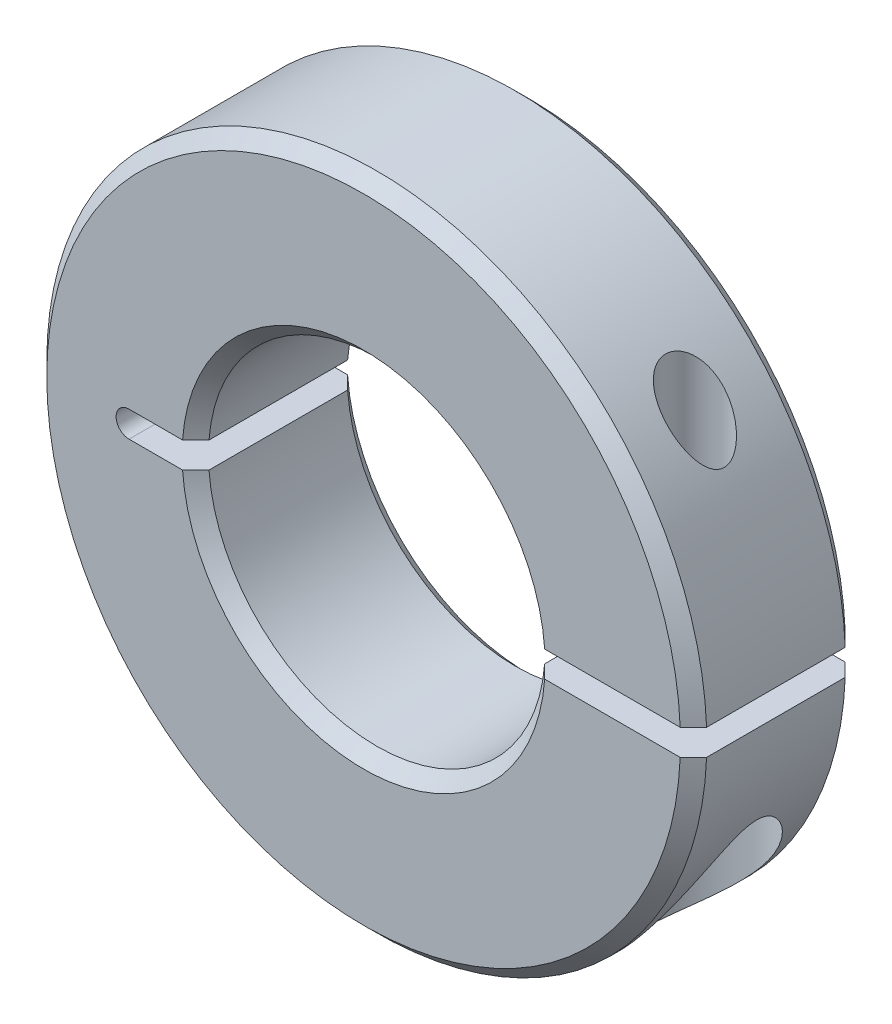
ISO-10303-21;
HEADER;
FILE_DESCRIPTION(('STEP AP214'),'2;1');
FILE_NAME('part.step','',(''),(''),'','','');
FILE_SCHEMA(('AUTOMOTIVE_DESIGN { 1 0 10303 214 1 1 1 1 }'));
ENDSEC;
DATA;
#1=APPLICATION_CONTEXT('core data for automotive mechanical design processes');
#2=APPLICATION_PROTOCOL_DEFINITION('international standard','automotive_design',2000,#1);
#3=PRODUCT_CONTEXT('',#1,'mechanical');
#4=PRODUCT('Part','Part','',(#3));
#5=PRODUCT_RELATED_PRODUCT_CATEGORY('part','',(#4));
#6=PRODUCT_DEFINITION_FORMATION('','',#4);
#7=PRODUCT_DEFINITION_CONTEXT('part definition',#1,'design');
#8=PRODUCT_DEFINITION('design','',#6,#7);
#9=PRODUCT_DEFINITION_SHAPE('','',#8);
#10=(LENGTH_UNIT() NAMED_UNIT(*) SI_UNIT(.MILLI.,.METRE.));
#11=(NAMED_UNIT(*) PLANE_ANGLE_UNIT() SI_UNIT($,.RADIAN.));
#12=(NAMED_UNIT(*) SI_UNIT($,.STERADIAN.) SOLID_ANGLE_UNIT());
#13=UNCERTAINTY_MEASURE_WITH_UNIT(LENGTH_MEASURE(1.E-05),#10,'distance_accuracy_value','');
#14=(GEOMETRIC_REPRESENTATION_CONTEXT(3) GLOBAL_UNCERTAINTY_ASSIGNED_CONTEXT((#13)) GLOBAL_UNIT_ASSIGNED_CONTEXT((#10,
#11,#12)) REPRESENTATION_CONTEXT('',''));
#15=CARTESIAN_POINT('',(0.,0.,0.));
#16=DIRECTION('',(0.,0.,1.));
#17=DIRECTION('',(1.,0.,0.));
#18=AXIS2_PLACEMENT_3D('',#15,#16,#17);
#19=CARTESIAN_POINT('',(5.0585421498754,0.0836122983138548,0.602080490523428));
#20=DIRECTION('',(0.,1.,0.));
#21=DIRECTION('',(0.,0.,1.));
#22=AXIS2_PLACEMENT_3D('',#19,#20,#21);
#23=PLANE('',#22);
#24=CARTESIAN_POINT('',(5.0585421498754,0.0836122983138548,0.602080490523428));
#25=DIRECTION('',(0.,1.,0.));
#26=DIRECTION('',(0.,0.,1.));
#27=AXIS2_PLACEMENT_3D('',#24,#25,#26);
#28=CIRCLE('',#27,1.63195);
#29=CARTESIAN_POINT('',(5.0585421498754,0.0836122983138548,2.23403049052343));
#30=VERTEX_POINT('',#29);
#31=EDGE_CURVE('E158',#30,#30,#28,.T.);
#32=ORIENTED_EDGE('',*,*,#31,.T.);
#33=EDGE_LOOP('',(#32));
#34=FACE_BOUND('',#33,.T.);
#35=CARTESIAN_POINT('',(5.0585421498754,0.0836122983138808,0.602080490523428));
#36=DIRECTION('',(0.,1.,0.));
#37=DIRECTION('',(0.,0.,1.));
#38=AXIS2_PLACEMENT_3D('',#35,#36,#37);
#39=CIRCLE('',#38,2.38125);
#40=CARTESIAN_POINT('',(5.0585421498754,0.0836122983138808,2.98333049052343));
#41=VERTEX_POINT('',#40);
#42=EDGE_CURVE('E212',#41,#41,#39,.F.);
#43=ORIENTED_EDGE('',*,*,#42,.T.);
#44=EDGE_LOOP('',(#43));
#45=FACE_BOUND('',#44,.T.);
#46=ADVANCED_FACE('F16',(#34,#45),#23,.F.);
#47=CARTESIAN_POINT('',(-4.51537073370326,2.61561229831282,3.77708049046532));
#48=DIRECTION('',(0.,0.,1.));
#49=DIRECTION('',(1.,0.,0.));
#50=AXIS2_PLACEMENT_3D('',#47,#48,#49);
#51=CONICAL_SURFACE('',#50,6.98499999991889,0.785398163397448);
#52=CARTESIAN_POINT('',(1.94230137007956,2.1156122983138,3.26908049054441));
#53=CARTESIAN_POINT('',(2.02721181713312,2.1156122983138,3.35373825603141));
#54=CARTESIAN_POINT('',(2.11211782590768,2.1156122983138,3.4384004721112));
#55=CARTESIAN_POINT('',(2.28192096688123,2.1156122983138,3.6077338054388));
#56=CARTESIAN_POINT('',(2.36681809908021,2.1156122983138,3.69240492268661));
#57=CARTESIAN_POINT('',(2.4517107930002,2.1156122983138,3.77708049052722));
#58=B_SPLINE_CURVE_WITH_KNOTS('',3,(#52,#53,#54,#55,#56,#57),.UNSPECIFIED.,.F.,.F.,(4,2,4),(0.,
0.359708896773636,0.719417793472673),.UNSPECIFIED.);
#59=CARTESIAN_POINT('',(1.94230137008047,2.1156122983138,3.26908049053367));
#60=VERTEX_POINT('',#59);
#61=CARTESIAN_POINT('',(2.45171079299767,2.1156122983138,3.77708049052469));
#62=VERTEX_POINT('',#61);
#63=EDGE_CURVE('E127',#60,#62,#58,.T.);
#64=ORIENTED_EDGE('',*,*,#63,.F.);
#65=CARTESIAN_POINT('',(-4.51537073370326,2.61561229831282,3.26908049052292));
#66=DIRECTION('',(0.,0.,-1.));
#67=DIRECTION('',(-1.,0.,0.));
#68=AXIS2_PLACEMENT_3D('',#65,#66,#67);
#69=CIRCLE('',#68,6.477);
#70=CARTESIAN_POINT('',(-10.9730428374867,2.1156122983138,3.26908049053363));
#71=VERTEX_POINT('',#70);
#72=EDGE_CURVE('E122',#60,#71,#69,.T.);
#73=ORIENTED_EDGE('',*,*,#72,.T.);
#74=CARTESIAN_POINT('',(-11.4824522604069,2.1156122983138,3.77708049052737));
#75=CARTESIAN_POINT('',(-11.3975595664868,2.1156122983138,3.69240492268673));
#76=CARTESIAN_POINT('',(-11.3126624342878,2.1156122983138,3.60773380543888));
#77=CARTESIAN_POINT('',(-11.1428592933142,2.1156122983138,3.4384004721112));
#78=CARTESIAN_POINT('',(-11.0579532845396,2.1156122983138,3.35373825603138));
#79=CARTESIAN_POINT('',(-10.973042837486,2.1156122983138,3.26908049054435));
#80=B_SPLINE_CURVE_WITH_KNOTS('',3,(#74,#75,#76,#77,#78,#79),.UNSPECIFIED.,.F.,.F.,(4,2,4),(0.,
0.35970889669919,0.71941779347298),.UNSPECIFIED.);
#81=CARTESIAN_POINT('',(-11.4824522604043,2.1156122983138,3.77708049052477));
#82=VERTEX_POINT('',#81);
#83=EDGE_CURVE('E19',#82,#71,#80,.T.);
#84=ORIENTED_EDGE('',*,*,#83,.F.);
#85=CARTESIAN_POINT('',(-4.51537073370326,2.61561229831282,3.77708049052217));
#86=DIRECTION('',(0.,0.,1.));
#87=DIRECTION('',(1.,0.,0.));
#88=AXIS2_PLACEMENT_3D('',#85,#86,#87);
#89=CIRCLE('',#88,6.98499999997574);
#90=EDGE_CURVE('E119',#62,#82,#89,.F.);
#91=ORIENTED_EDGE('',*,*,#90,.F.);
#92=EDGE_LOOP('',(#64,#73,#84,#91));
#93=FACE_BOUND('',#92,.T.);
#94=ADVANCED_FACE('F118',(#93),#51,.F.);
#95=CARTESIAN_POINT('',(-4.51537073370326,2.61561229831282,3.77708049046532));
#96=DIRECTION('',(0.,0.,1.));
#97=DIRECTION('',(1.,0.,0.));
#98=AXIS2_PLACEMENT_3D('',#95,#96,#97);
#99=CONICAL_SURFACE('',#98,6.98499999991889,0.785398163397448);
#100=CARTESIAN_POINT('',(-10.9730428374859,3.11561229831336,3.26908049054436));
#101=CARTESIAN_POINT('',(-11.0579532845395,3.11561229831336,3.35373825603139));
#102=CARTESIAN_POINT('',(-11.1428592933141,3.11561229831336,3.43840047211122));
#103=CARTESIAN_POINT('',(-11.3126624342877,3.11561229831336,3.6077338054389));
#104=CARTESIAN_POINT('',(-11.3975595664868,3.11561229831336,3.69240492268675));
#105=CARTESIAN_POINT('',(-11.4824522604068,3.11561229831336,3.77708049052739));
#106=B_SPLINE_CURVE_WITH_KNOTS('',3,(#100,#101,#102,#103,#104,#105),.UNSPECIFIED.,.F.,.F.,(4,2,
4),(0.,0.359708896773799,0.719417793472996),.UNSPECIFIED.);
#107=CARTESIAN_POINT('',(-10.9730428374867,3.11561229831336,3.26908049053364));
#108=VERTEX_POINT('',#107);
#109=CARTESIAN_POINT('',(-11.4824522604042,3.11561229831336,3.77708049052478));
#110=VERTEX_POINT('',#109);
#111=EDGE_CURVE('E232',#108,#110,#106,.T.);
#112=ORIENTED_EDGE('',*,*,#111,.F.);
#113=CARTESIAN_POINT('',(-4.51537073370326,2.61561229831282,3.26908049052292));
#114=DIRECTION('',(0.,0.,-1.));
#115=DIRECTION('',(-1.,0.,0.));
#116=AXIS2_PLACEMENT_3D('',#113,#114,#115);
#117=CIRCLE('',#116,6.477);
#118=CARTESIAN_POINT('',(1.94230137008042,3.11561229831336,3.26908049053367));
#119=VERTEX_POINT('',#118);
#120=EDGE_CURVE('E325',#108,#119,#117,.T.);
#121=ORIENTED_EDGE('',*,*,#120,.T.);
#122=CARTESIAN_POINT('',(2.45171079300011,3.11561229831336,3.77708049052724));
#123=CARTESIAN_POINT('',(2.36681809908012,3.11561229831336,3.69240492268663));
#124=CARTESIAN_POINT('',(2.28192096688113,3.11561229831336,3.60773380543882));
#125=CARTESIAN_POINT('',(2.11211782590758,3.11561229831336,3.43840047211121));
#126=CARTESIAN_POINT('',(2.02721181713302,3.11561229831336,3.35373825603142));
#127=CARTESIAN_POINT('',(1.94230137007946,3.11561229831336,3.26908049054443));
#128=B_SPLINE_CURVE_WITH_KNOTS('',3,(#122,#123,#124,#125,#126,#127),.UNSPECIFIED.,.F.,.F.,(4,2,
4),(0.,0.359708896699044,0.719417793472688),.UNSPECIFIED.);
#129=CARTESIAN_POINT('',(2.45171079299757,3.11561229831336,3.7770804905247));
#130=VERTEX_POINT('',#129);
#131=EDGE_CURVE('E259',#130,#119,#128,.T.);
#132=ORIENTED_EDGE('',*,*,#131,.F.);
#133=CARTESIAN_POINT('',(-4.51537073370326,2.61561229831282,3.77708049052217));
#134=DIRECTION('',(0.,0.,1.));
#135=DIRECTION('',(1.,0.,0.));
#136=AXIS2_PLACEMENT_3D('',#133,#134,#135);
#137=CIRCLE('',#136,6.98499999997574);
#138=EDGE_CURVE('E404',#110,#130,#137,.F.);
#139=ORIENTED_EDGE('',*,*,#138,.F.);
#140=EDGE_LOOP('',(#112,#121,#132,#139));
#141=FACE_BOUND('',#140,.T.);
#142=ADVANCED_FACE('F265',(#141),#99,.F.);
#143=CARTESIAN_POINT('',(5.0585421498754,-10.0843877016872,0.602080490523428));
#144=DIRECTION('',(0.,1.,0.));
#145=DIRECTION('',(0.,0.,1.));
#146=AXIS2_PLACEMENT_3D('',#143,#144,#145);
#147=CYLINDRICAL_SURFACE('',#146,2.38125);
#148=ORIENTED_EDGE('',*,*,#42,.F.);
#149=EDGE_LOOP('',(#148));
#150=FACE_BOUND('',#149,.T.);
#151=CARTESIAN_POINT('',(5.05854214987587,-5.72885845168909,2.98333049052343));
#152=CARTESIAN_POINT('',(5.1636729661427,-5.60824059387987,2.98332926045928));
#153=CARTESIAN_POINT('',(5.26648529143292,-5.48566643382376,2.97638273128389));
#154=CARTESIAN_POINT('',(5.46683857369114,-5.23747268409364,2.95024106640301));
#155=CARTESIAN_POINT('',(5.56437661840899,-5.11185146629979,2.93103923722344));
#156=CARTESIAN_POINT('',(5.75384258269392,-4.85823308520226,2.88166611622152));
#157=CARTESIAN_POINT('',(5.84576031840472,-4.73023212679233,2.85147556315454));
#158=CARTESIAN_POINT('',(6.02352997933439,-4.47283135103545,2.78113665868113));
#159=CARTESIAN_POINT('',(6.1093833167514,-4.34343186750511,2.74099063546233));
#160=CARTESIAN_POINT('',(6.278933009773,-4.07759677896215,2.64921056468325));
#161=CARTESIAN_POINT('',(6.36232148811594,-3.94112499515531,2.59711283051411));
#162=CARTESIAN_POINT('',(6.52218077902737,-3.66829260641997,2.48297437047656));
#163=CARTESIAN_POINT('',(6.598651389301,-3.53193200485817,2.42093335398994));
#164=CARTESIAN_POINT('',(6.74485836653093,-3.2598580908083,2.28630989782759));
#165=CARTESIAN_POINT('',(6.81456464788705,-3.12415001283055,2.21368366407462));
#166=CARTESIAN_POINT('',(6.91350540932779,-2.92301431895487,2.09609223743806));
#167=CARTESIAN_POINT('',(6.94553700223406,-2.85640083103791,2.05547186807675));
#168=CARTESIAN_POINT('',(7.00766808685965,-2.7243217000318,1.97102565217308));
#169=CARTESIAN_POINT('',(7.03776795435329,-2.65885583550995,1.92720043263368));
#170=CARTESIAN_POINT('',(7.09790374711412,-2.52516434442873,1.8328117690146));
#171=CARTESIAN_POINT('',(7.12779637468702,-2.45705342520329,1.78199281708044));
#172=CARTESIAN_POINT('',(7.18500540809149,-2.32366427425492,1.6754681995039));
#173=CARTESIAN_POINT('',(7.21232358519668,-2.25838411185719,1.61976594536192));
#174=CARTESIAN_POINT('',(7.26374587115533,-2.1327527840435,1.50289832549498));
#175=CARTESIAN_POINT('',(7.28787826936617,-2.07236038215786,1.44179042248133));
#176=CARTESIAN_POINT('',(7.33244570183273,-1.95854781240816,1.31228627733213));
#177=CARTESIAN_POINT('',(7.35289265260793,-1.90510533468333,1.24391470440207));
#178=CARTESIAN_POINT('',(7.38274478609094,-1.8257851210208,1.12257710597063));
#179=CARTESIAN_POINT('',(7.39355538958726,-1.79666740442459,1.07211075276556));
#180=CARTESIAN_POINT('',(7.4122595037444,-1.74585183272493,0.9670422790555));
#181=CARTESIAN_POINT('',(7.4201587795716,-1.72413931987693,0.912448593049697));
#182=CARTESIAN_POINT('',(7.43100750336761,-1.69417323028252,0.811336324103905));
#183=CARTESIAN_POINT('',(7.43463863376694,-1.68407587696287,0.765447783932842));
#184=CARTESIAN_POINT('',(7.43920364518567,-1.67136802929189,0.672507525691282));
#185=CARTESIAN_POINT('',(7.44013957538522,-1.66875184696283,0.625456718767812));
#186=CARTESIAN_POINT('',(7.43921159153434,-1.67134027071528,0.531581682409648));
#187=CARTESIAN_POINT('',(7.43734620345178,-1.67654899420252,0.484757585276548));
#188=CARTESIAN_POINT('',(7.43101655278466,-1.69413418533111,0.392662983443679));
#189=CARTESIAN_POINT('',(7.42654965293511,-1.70651792653232,0.34739410472399));
#190=CARTESIAN_POINT('',(7.41306123682339,-1.74363526966314,0.240733236122302));
#191=CARTESIAN_POINT('',(7.40291513192216,-1.77137037637279,0.180544387484741));
#192=CARTESIAN_POINT('',(7.37927691190695,-1.83506295053788,0.0654015209409915));
#193=CARTESIAN_POINT('',(7.36577486209946,-1.87104480597821,0.0104637287488415));
#194=CARTESIAN_POINT('',(7.33704057625,-1.94639243882688,-0.0917929714523885));
#195=CARTESIAN_POINT('',(7.32193900667011,-1.9854754283813,-0.139361943593446));
#196=CARTESIAN_POINT('',(7.28990032343938,-2.06706932088746,-0.230828837543826));
#197=CARTESIAN_POINT('',(7.2729614620321,-2.10958347778522,-0.274723192238821));
#198=CARTESIAN_POINT('',(7.21976721569489,-2.24086915375242,-0.401888050360638));
#199=CARTESIAN_POINT('',(7.18118997226445,-2.33323533190077,-0.480454994790211));
#200=CARTESIAN_POINT('',(7.09291612052595,-2.5372399258707,-0.639331341668745));
#201=CARTESIAN_POINT('',(7.04241999071544,-2.6496840040761,-0.71811652445704));
#202=CARTESIAN_POINT('',(6.93556613712975,-2.87820170233106,-0.866063091166438));
#203=CARTESIAN_POINT('',(6.87920187097191,-2.99427927035114,-0.935213528141372));
#204=CARTESIAN_POINT('',(6.76088884879874,-3.22846348209324,-1.06528335273531));
#205=CARTESIAN_POINT('',(6.69893069951608,-3.34657325871662,-1.12618844954373));
#206=CARTESIAN_POINT('',(6.56966553412652,-3.58359754583642,-1.24027779679415));
#207=CARTESIAN_POINT('',(6.50235793567282,-3.70251214265381,-1.29346120485849));
#208=CARTESIAN_POINT('',(6.35364415172039,-3.95543546477248,-1.39851089653848));
#209=CARTESIAN_POINT('',(6.27153125428238,-4.08945230370158,-1.44936109448347));
#210=CARTESIAN_POINT('',(6.10071671659847,-4.35675133421256,-1.54119401364224));
#211=CARTESIAN_POINT('',(6.01201265830238,-4.49003323671903,-1.5821730898911));
#212=CARTESIAN_POINT('',(5.82857038129524,-4.75450859569842,-1.65336845221677));
#213=CARTESIAN_POINT('',(5.7338574624546,-4.88570823442463,-1.6836267373562));
#214=CARTESIAN_POINT('',(5.53841541188708,-5.14568846043319,-1.73248777331749));
#215=CARTESIAN_POINT('',(5.43769098826965,-5.27447083960028,-1.75109951763919));
#216=CARTESIAN_POINT('',(5.2892867453528,-5.45679535229787,-1.76839456104505));
#217=CARTESIAN_POINT('',(5.24383765419824,-5.51168310481385,-1.77239523145794));
#218=CARTESIAN_POINT('',(5.151930309904,-5.62079393717198,-1.77778303365589));
#219=CARTESIAN_POINT('',(5.10547139487124,-5.67501654224754,-1.77916839556533));
#220=CARTESIAN_POINT('',(4.92670269638801,-5.88011781919474,-1.77917263881415));
#221=CARTESIAN_POINT('',(4.79115125715134,-6.02837262207464,-1.76825086595407));
#222=CARTESIAN_POINT('',(4.5151633808464,-6.3163059821399,-1.72056788826372));
#223=CARTESIAN_POINT('',(4.37472472375227,-6.45598055993555,-1.68379479087225));
#224=CARTESIAN_POINT('',(4.11579206141953,-6.70209722870821,-1.58823166135407));
#225=CARTESIAN_POINT('',(3.99735767710207,-6.8102929640127,-1.53386959358499));
#226=CARTESIAN_POINT('',(3.76431946808483,-7.01562486489753,-1.40122824130146));
#227=CARTESIAN_POINT('',(3.64971041680169,-7.11277659692119,-1.32298320801143));
#228=CARTESIAN_POINT('',(3.44981648095996,-7.27678030507193,-1.15747379272369));
#229=CARTESIAN_POINT('',(3.36297248207745,-7.34593619655476,-1.07438635588681));
#230=CARTESIAN_POINT('',(3.19950567173118,-7.47306369065948,-0.891023836364133));
#231=CARTESIAN_POINT('',(3.12288082163188,-7.53103752504204,-0.790752190933175));
#232=CARTESIAN_POINT('',(3.01872356686482,-7.60834667669835,-0.628245927420808));
#233=CARTESIAN_POINT('',(2.98567536642292,-7.63259604083546,-0.571774817336288));
#234=CARTESIAN_POINT('',(2.92386699371388,-7.67755027980125,-0.455206753095219));
#235=CARTESIAN_POINT('',(2.89510458766079,-7.69825700191954,-0.395111710863484));
#236=CARTESIAN_POINT('',(2.84239809414803,-7.73592342400338,-0.271735352749508));
#237=CARTESIAN_POINT('',(2.81845244793583,-7.75288433632566,-0.208455075956289));
#238=CARTESIAN_POINT('',(2.77583720452284,-7.78289529844024,-0.0792736258010578));
#239=CARTESIAN_POINT('',(2.75716670737555,-7.79594601533935,-0.0133729016813554));
#240=CARTESIAN_POINT('',(2.71402908068881,-7.82598375918691,0.168934054258077));
#241=CARTESIAN_POINT('',(2.69513258813854,-7.83899334690568,0.287403340390556));
#242=CARTESIAN_POINT('',(2.67547266493352,-7.85252596644331,0.526446357101758));
#243=CARTESIAN_POINT('',(2.67469974932853,-7.85305552966736,0.647018953848185));
#244=CARTESIAN_POINT('',(2.69065246473462,-7.84207861189454,0.877341309667541));
#245=CARTESIAN_POINT('',(2.70607564397205,-7.83146800926414,0.987226884551053));
#246=CARTESIAN_POINT('',(2.75156938483536,-7.79987331448673,1.20234362062475));
#247=CARTESIAN_POINT('',(2.78163885793388,-7.77888999324892,1.30757512707612));
#248=CARTESIAN_POINT('',(2.85536624670995,-7.72674173960129,1.51222786628534));
#249=CARTESIAN_POINT('',(2.89921073954565,-7.6954366968902,1.61154559220472));
#250=CARTESIAN_POINT('',(2.9981853732695,-7.62353842342159,1.80070004795079));
#251=CARTESIAN_POINT('',(3.05331812112777,-7.58294304684915,1.89053458040147));
#252=CARTESIAN_POINT('',(3.17785531836749,-7.48937868370258,2.06702226164442));
#253=CARTESIAN_POINT('',(3.2480966432298,-7.43562606161058,2.1526658700426));
#254=CARTESIAN_POINT('',(3.39615374306556,-7.31951045197439,2.31045673887011));
#255=CARTESIAN_POINT('',(3.47397444083853,-7.25714185720934,2.38259513759809));
#256=CARTESIAN_POINT('',(3.67043732338443,-7.09546588655666,2.54268922356675));
#257=CARTESIAN_POINT('',(3.79176847713142,-6.9921145479682,2.62328617400688));
#258=CARTESIAN_POINT('',(4.03815197670108,-6.77345216407877,2.75822899989444));
#259=CARTESIAN_POINT('',(4.16321041377104,-6.65812067904827,2.81252908539852));
#260=CARTESIAN_POINT('',(4.41941509556922,-6.41173111371542,2.90016783461979));
#261=CARTESIAN_POINT('',(4.55051056423357,-6.28015419806128,2.93216404834599));
#262=CARTESIAN_POINT('',(4.80831837647691,-6.00957152818119,2.9737471458535));
#263=CARTESIAN_POINT('',(4.9350303093961,-5.87056508102729,2.98333193565143));
#264=CARTESIAN_POINT('',(5.05854214987587,-5.72885845168909,2.98333049052343));
#265=B_SPLINE_CURVE_WITH_KNOTS('',3,(#151,#152,#153,#154,#155,#156,#157,#158,#159,#160,#161,
#162,#163,#164,#165,#166,#167,#168,#169,#170,#171,#172,#173,#174,#175,#176,#177,#178,#179,#180,
#181,#182,#183,#184,#185,#186,#187,#188,#189,#190,#191,#192,#193,#194,#195,#196,#197,#198,#199,
#200,#201,#202,#203,#204,#205,#206,#207,#208,#209,#210,#211,#212,#213,#214,#215,#216,#217,#218,
#219,#220,#221,#222,#223,#224,#225,#226,#227,#228,#229,#230,#231,#232,#233,#234,#235,#236,#237,
#238,#239,#240,#241,#242,#243,#244,#245,#246,#247,#248,#249,#250,#251,#252,#253,#254,#255,#256,
#257,#258,#259,#260,#261,#262,#263,#264),.UNSPECIFIED.,.T.,.F.,(4,2,2,2,2,2,2,2,2,2,2,2,2,2,2,2,
2,2,2,2,2,2,2,2,2,2,2,2,2,2,2,2,2,2,2,2,2,2,2,2,2,2,2,2,2,2,2,2,2,2,2,2,2,2,2,2,4),(0.,
0.479789284369426,0.959840839637402,1.44073792281267,1.92152264921364,2.42568567914013,
2.92986344722655,3.43618969288175,3.6891414257221,3.94204380232511,4.21212941225193,
4.48202782004881,4.74934002455972,5.01577175935628,5.19305823331214,5.36999172442964,
5.51076368023033,5.65142857780227,5.7921675181001,5.93304938050498,6.13303349019064,
6.33361682035742,6.52350338316906,6.7135721899646,7.09443499507504,7.53273745783604,
7.97153392581862,8.41108143602902,8.85067686156619,9.34583393138683,9.8411735613036,
10.334550648264,10.8275462760244,11.0416171802149,11.2558329022139,11.8576342676449,
12.4597126651879,12.9661032675709,13.4717710263806,13.8861696902251,14.3004855609141,
14.5095610550629,14.7185271935437,14.9274255992766,15.1362883451524,15.4961784781187,
15.8558802588495,16.1887201118842,16.5215352316981,16.8590680806406,17.1966789693331,
17.5645972271494,17.9327560618342,18.4655965345294,18.9993615198538,19.5629842857134,
20.1266597108575),.UNSPECIFIED.);
#266=CARTESIAN_POINT('',(5.05854214987587,-5.72885845168909,2.98333049052343));
#267=VERTEX_POINT('',#266);
#268=EDGE_CURVE('E315',#267,#267,#265,.T.);
#269=ORIENTED_EDGE('',*,*,#268,.F.);
#270=EDGE_LOOP('',(#269));
#271=FACE_BOUND('',#270,.T.);
#272=ADVANCED_FACE('F221',(#150,#271),#147,.F.);
#273=CARTESIAN_POINT('',(-4.51537073370326,2.61561229831282,3.2690804905224));
#274=DIRECTION('',(0.,0.,-1.));
#275=DIRECTION('',(0.,1.,0.));
#276=AXIS2_PLACEMENT_3D('',#273,#274,#275);
#277=CONICAL_SURFACE('',#276,12.7000000000004,0.7853981633973);
#278=CARTESIAN_POINT('',(-4.51537073370326,2.61561229831282,3.26908049052292));
#279=DIRECTION('',(0.,0.,-1.));
#280=DIRECTION('',(-1.,0.,0.));
#281=AXIS2_PLACEMENT_3D('',#278,#279,#280);
#282=CIRCLE('',#281,12.7);
#283=CARTESIAN_POINT('',(8.17478292966962,2.1156122983138,3.26908049052273));
#284=VERTEX_POINT('',#283);
#285=CARTESIAN_POINT('',(8.1747829296696,3.11561229831336,3.26908049052272));
#286=VERTEX_POINT('',#285);
#287=EDGE_CURVE('E312',#284,#286,#282,.T.);
#288=ORIENTED_EDGE('',*,*,#287,.F.);
#289=CARTESIAN_POINT('',(8.17478292966932,2.1156122983138,3.26908049052255));
#290=CARTESIAN_POINT('',(8.09004922641637,2.1156122983138,3.35374855548976));
#291=CARTESIAN_POINT('',(8.00531482457778,2.1156122983138,3.43841592130669));
#292=CARTESIAN_POINT('',(7.83584462372912,2.1156122983138,3.60774925464023));
#293=CARTESIAN_POINT('',(7.75110882471904,2.1156122983138,3.69241522215684));
#294=CARTESIAN_POINT('',(7.66637232712333,2.1156122983138,3.77708049052317));
#295=B_SPLINE_CURVE_WITH_KNOTS('',3,(#289,#290,#291,#292,#293,#294),.UNSPECIFIED.,.F.,.F.,(4,2,
4),(0.,0.359355444099413,0.718710888199824),.UNSPECIFIED.);
#296=CARTESIAN_POINT('',(7.66637232712333,2.1156122983138,3.77708049052317));
#297=VERTEX_POINT('',#296);
#298=EDGE_CURVE('E227',#284,#297,#295,.T.);
#299=ORIENTED_EDGE('',*,*,#298,.T.);
#300=CARTESIAN_POINT('',(-4.51537073370326,2.61561229831282,3.77708049052317));
#301=DIRECTION('',(0.,0.,-1.));
#302=DIRECTION('',(0.,1.,0.));
#303=AXIS2_PLACEMENT_3D('',#300,#301,#302);
#304=CIRCLE('',#303,12.1919999999998);
#305=CARTESIAN_POINT('',(7.6663723271234,3.11561229831336,3.77708049052303));
#306=VERTEX_POINT('',#305);
#307=EDGE_CURVE('E328',#306,#297,#304,.F.);
#308=ORIENTED_EDGE('',*,*,#307,.F.);
#309=CARTESIAN_POINT('',(7.66637232712333,3.11561229831336,3.7770804905231));
#310=CARTESIAN_POINT('',(7.75110882471904,3.11561229831336,3.69241522215678));
#311=CARTESIAN_POINT('',(7.83584462372911,3.11561229831336,3.60774925464018));
#312=CARTESIAN_POINT('',(8.00531482457776,3.11561229831336,3.43841592130665));
#313=CARTESIAN_POINT('',(8.09004922641634,3.11561229831336,3.35374855548972));
#314=CARTESIAN_POINT('',(8.17478292966928,3.11561229831336,3.26908049052252));
#315=B_SPLINE_CURVE_WITH_KNOTS('',3,(#309,#310,#311,#312,#313,#314),.UNSPECIFIED.,.F.,.F.,(4,2,
4),(0.,0.359355444100381,0.718710888199763),.UNSPECIFIED.);
#316=EDGE_CURVE('E205',#306,#286,#315,.T.);
#317=ORIENTED_EDGE('',*,*,#316,.T.);
#318=EDGE_LOOP('',(#288,#299,#308,#317));
#319=FACE_BOUND('',#318,.T.);
#320=ADVANCED_FACE('F215',(#319),#277,.T.);
#321=CARTESIAN_POINT('',(5.0585421498754,2.1156122983138,0.602080490523428));
#322=DIRECTION('',(0.,1.,0.));
#323=DIRECTION('',(0.,0.,1.));
#324=AXIS2_PLACEMENT_3D('',#321,#322,#323);
#325=CYLINDRICAL_SURFACE('',#324,1.63195);
#326=CARTESIAN_POINT('',(5.0585421498754,2.1156122983138,0.602080490523428));
#327=DIRECTION('',(0.,1.,0.));
#328=DIRECTION('',(0.,0.,1.));
#329=AXIS2_PLACEMENT_3D('',#326,#327,#328);
#330=CIRCLE('',#329,1.63195);
#331=CARTESIAN_POINT('',(5.0585421498754,2.1156122983138,2.23403049052343));
#332=VERTEX_POINT('',#331);
#333=EDGE_CURVE('E155',#332,#332,#330,.F.);
#334=ORIENTED_EDGE('',*,*,#333,.F.);
#335=EDGE_LOOP('',(#334));
#336=FACE_BOUND('',#335,.T.);
#337=ORIENTED_EDGE('',*,*,#31,.F.);
#338=EDGE_LOOP('',(#337));
#339=FACE_BOUND('',#338,.T.);
#340=ADVANCED_FACE('F220',(#336,#339),#325,.F.);
#341=CARTESIAN_POINT('',(-4.51537073370326,2.61561229831282,3.77708049052292));
#342=DIRECTION('',(0.,0.,-1.));
#343=DIRECTION('',(-1.,0.,0.));
#344=AXIS2_PLACEMENT_3D('',#341,#342,#343);
#345=CYLINDRICAL_SURFACE('',#344,6.477);
#346=DIRECTION('',(0.,0.,1.));
#347=VECTOR('',#346,1.);
#348=CARTESIAN_POINT('',(1.94230137008139,2.1156122983138,-2.57291950947708));
#349=LINE('',#348,#347);
#350=CARTESIAN_POINT('',(1.94230137006719,2.1156122983138,-2.0649195094648));
#351=VERTEX_POINT('',#350);
#352=EDGE_CURVE('E152',#351,#60,#349,.T.);
#353=ORIENTED_EDGE('',*,*,#352,.F.);
#354=CARTESIAN_POINT('',(-4.51537073370326,2.61561229831282,-2.06491950945065));
#355=DIRECTION('',(0.,0.,-1.));
#356=DIRECTION('',(-1.,0.,0.));
#357=AXIS2_PLACEMENT_3D('',#354,#355,#356);
#358=CIRCLE('',#357,6.4769999999715);
#359=CARTESIAN_POINT('',(-10.9730428374735,2.1156122983138,-2.06491950946454));
#360=VERTEX_POINT('',#359);
#361=EDGE_CURVE('E143',#351,#360,#358,.T.);
#362=ORIENTED_EDGE('',*,*,#361,.T.);
#363=DIRECTION('',(0.,0.,-1.));
#364=VECTOR('',#363,1.);
#365=CARTESIAN_POINT('',(-10.9730428374874,2.1156122983138,3.77708049052292));
#366=LINE('',#365,#364);
#367=EDGE_CURVE('E151',#360,#71,#366,.F.);
#368=ORIENTED_EDGE('',*,*,#367,.T.);
#369=ORIENTED_EDGE('',*,*,#72,.F.);
#370=EDGE_LOOP('',(#353,#362,#368,#369));
#371=FACE_BOUND('',#370,.T.);
#372=ADVANCED_FACE('F390',(#371),#345,.F.);
#373=CARTESIAN_POINT('',(-13.5403707337027,2.61561229831282,-2.57291950947708));
#374=DIRECTION('',(0.,0.,-1.));
#375=DIRECTION('',(-1.,0.,0.));
#376=AXIS2_PLACEMENT_3D('',#373,#374,#375);
#377=CYLINDRICAL_SURFACE('',#376,0.500000000000032);
#378=CARTESIAN_POINT('',(-13.5403707337027,2.61561229831282,3.77708049052292));
#379=DIRECTION('',(0.,0.,-1.));
#380=DIRECTION('',(-1.,0.,0.));
#381=AXIS2_PLACEMENT_3D('',#378,#379,#380);
#382=CIRCLE('',#381,0.500000000000032);
#383=CARTESIAN_POINT('',(-13.5403707337027,2.1156122983138,3.77708049052292));
#384=VERTEX_POINT('',#383);
#385=CARTESIAN_POINT('',(-13.5403707337027,3.11561229831336,3.77708049052292));
#386=VERTEX_POINT('',#385);
#387=EDGE_CURVE('E135',#384,#386,#382,.T.);
#388=ORIENTED_EDGE('',*,*,#387,.F.);
#389=DIRECTION('',(0.,0.,-1.));
#390=VECTOR('',#389,1.);
#391=CARTESIAN_POINT('',(-13.5403707337027,2.1156122983138,3.77708049052292));
#392=LINE('',#391,#390);
#393=CARTESIAN_POINT('',(-13.5403707337027,2.1156122983138,-2.57291950947708));
#394=VERTEX_POINT('',#393);
#395=EDGE_CURVE('E142',#384,#394,#392,.T.);
#396=ORIENTED_EDGE('',*,*,#395,.T.);
#397=CARTESIAN_POINT('',(-13.5403707337027,2.61561229831282,-2.57291950947708));
#398=DIRECTION('',(0.,0.,-1.));
#399=DIRECTION('',(-1.,0.,0.));
#400=AXIS2_PLACEMENT_3D('',#397,#398,#399);
#401=CIRCLE('',#400,0.500000000000032);
#402=CARTESIAN_POINT('',(-13.5403707337027,3.11561229831336,-2.57291950947708));
#403=VERTEX_POINT('',#402);
#404=EDGE_CURVE('E136',#403,#394,#401,.F.);
#405=ORIENTED_EDGE('',*,*,#404,.F.);
#406=DIRECTION('',(0.,0.,1.));
#407=VECTOR('',#406,1.);
#408=CARTESIAN_POINT('',(-13.5403707337027,3.11561229831336,3.77708049052292));
#409=LINE('',#408,#407);
#410=EDGE_CURVE('E299',#403,#386,#409,.T.);
#411=ORIENTED_EDGE('',*,*,#410,.T.);
#412=EDGE_LOOP('',(#388,#396,#405,#411));
#413=FACE_BOUND('',#412,.T.);
#414=ADVANCED_FACE('F388',(#413),#377,.F.);
#415=CARTESIAN_POINT('',(-4.51537073370326,2.61561229831282,3.77708049052292));
#416=DIRECTION('',(0.,0.,1.));
#417=DIRECTION('',(1.,0.,0.));
#418=AXIS2_PLACEMENT_3D('',#415,#416,#417);
#419=PLANE('',#418);
#420=ORIENTED_EDGE('',*,*,#307,.T.);
#421=DIRECTION('',(1.,0.,0.));
#422=VECTOR('',#421,1.);
#423=CARTESIAN_POINT('',(8.18462926629674,2.1156122983138,3.77708049052292));
#424=LINE('',#423,#422);
#425=EDGE_CURVE('E134',#62,#297,#424,.T.);
#426=ORIENTED_EDGE('',*,*,#425,.F.);
#427=ORIENTED_EDGE('',*,*,#90,.T.);
#428=DIRECTION('',(1.,0.,0.));
#429=VECTOR('',#428,1.);
#430=CARTESIAN_POINT('',(-14.0403707337033,2.1156122983138,3.77708049052292));
#431=LINE('',#430,#429);
#432=EDGE_CURVE('E132',#82,#384,#431,.F.);
#433=ORIENTED_EDGE('',*,*,#432,.T.);
#434=ORIENTED_EDGE('',*,*,#387,.T.);
#435=DIRECTION('',(1.,0.,0.));
#436=VECTOR('',#435,1.);
#437=CARTESIAN_POINT('',(-14.0403707337033,3.11561229831336,3.77708049052292));
#438=LINE('',#437,#436);
#439=EDGE_CURVE('E301',#386,#110,#438,.T.);
#440=ORIENTED_EDGE('',*,*,#439,.T.);
#441=ORIENTED_EDGE('',*,*,#138,.T.);
#442=DIRECTION('',(1.,0.,0.));
#443=VECTOR('',#442,1.);
#444=CARTESIAN_POINT('',(8.18462926629674,3.11561229831336,3.77708049052292));
#445=LINE('',#444,#443);
#446=EDGE_CURVE('E321',#306,#130,#445,.F.);
#447=ORIENTED_EDGE('',*,*,#446,.F.);
#448=EDGE_LOOP('',(#420,#426,#427,#433,#434,#440,#441,#447));
#449=FACE_BOUND('',#448,.T.);
#450=ADVANCED_FACE('F131',(#449),#419,.T.);
#451=CARTESIAN_POINT('',(-4.51537073370326,2.61561229831282,3.77708049052292));
#452=DIRECTION('',(0.,0.,-1.));
#453=DIRECTION('',(-1.,0.,0.));
#454=AXIS2_PLACEMENT_3D('',#451,#452,#453);
#455=CYLINDRICAL_SURFACE('',#454,6.477);
#456=DIRECTION('',(0.,0.,1.));
#457=VECTOR('',#456,1.);
#458=CARTESIAN_POINT('',(-10.9730428374874,3.11561229831336,3.77708049052292));
#459=LINE('',#458,#457);
#460=CARTESIAN_POINT('',(-10.9730428374734,3.11561229831336,-2.0649195094646));
#461=VERTEX_POINT('',#460);
#462=EDGE_CURVE('E302',#108,#461,#459,.F.);
#463=ORIENTED_EDGE('',*,*,#462,.T.);
#464=CARTESIAN_POINT('',(-4.51537073370326,2.61561229831282,-2.06491950945065));
#465=DIRECTION('',(0.,0.,-1.));
#466=DIRECTION('',(-1.,0.,0.));
#467=AXIS2_PLACEMENT_3D('',#464,#465,#466);
#468=CIRCLE('',#467,6.4769999999715);
#469=CARTESIAN_POINT('',(1.94230137006714,3.11561229831336,-2.06491950946486));
#470=VERTEX_POINT('',#469);
#471=EDGE_CURVE('E318',#461,#470,#468,.T.);
#472=ORIENTED_EDGE('',*,*,#471,.T.);
#473=DIRECTION('',(0.,0.,-1.));
#474=VECTOR('',#473,1.);
#475=CARTESIAN_POINT('',(1.94230137008139,3.11561229831336,-2.57291950947708));
#476=LINE('',#475,#474);
#477=EDGE_CURVE('E323',#119,#470,#476,.T.);
#478=ORIENTED_EDGE('',*,*,#477,.F.);
#479=ORIENTED_EDGE('',*,*,#120,.F.);
#480=EDGE_LOOP('',(#463,#472,#478,#479));
#481=FACE_BOUND('',#480,.T.);
#482=ADVANCED_FACE('F370',(#481),#455,.F.);
#483=CARTESIAN_POINT('',(5.0585421498754,3.11561229831336,0.602080490523428));
#484=DIRECTION('',(0.,-1.,0.));
#485=DIRECTION('',(0.,0.,-1.));
#486=AXIS2_PLACEMENT_3D('',#483,#484,#485);
#487=CYLINDRICAL_SURFACE('',#486,1.1303);
#488=CARTESIAN_POINT('',(5.0585421498754,3.11561229831336,0.602080490523428));
#489=DIRECTION('',(0.,-1.,0.));
#490=DIRECTION('',(0.,0.,-1.));
#491=AXIS2_PLACEMENT_3D('',#488,#489,#490);
#492=CIRCLE('',#491,1.1303);
#493=CARTESIAN_POINT('',(5.0585421498754,3.11561229831336,-0.528219509476572));
#494=VERTEX_POINT('',#493);
#495=EDGE_CURVE('E306',#494,#494,#492,.F.);
#496=ORIENTED_EDGE('',*,*,#495,.F.);
#497=EDGE_LOOP('',(#496));
#498=FACE_BOUND('',#497,.T.);
#499=CARTESIAN_POINT('',(5.05854214987461,10.9600830483162,-0.528219509476572));
#500=CARTESIAN_POINT('',(5.10809265276071,10.903232242637,-0.528219375001278));
#501=CARTESIAN_POINT('',(5.1571289113226,10.8459462116043,-0.524967428574107));
#502=CARTESIAN_POINT('',(5.25384380417201,10.7309123473523,-0.512286759290883));
#503=CARTESIAN_POINT('',(5.3015223291526,10.6731644774283,-0.502857540580494));
#504=CARTESIAN_POINT('',(5.39532810171902,10.5575012939379,-0.47797200588839));
#505=CARTESIAN_POINT('',(5.44145199314088,10.499585878843,-0.462503457406321));
#506=CARTESIAN_POINT('',(5.53173391357899,10.3842068649716,-0.425559832624208));
#507=CARTESIAN_POINT('',(5.5758928852992,10.3267430606646,-0.404087673474082));
#508=CARTESIAN_POINT('',(5.67775681923355,10.1918662776051,-0.345943643531839));
#509=CARTESIAN_POINT('',(5.73451014141504,10.1148425904926,-0.306584842468668));
#510=CARTESIAN_POINT('',(5.81554556752923,10.0023786303337,-0.238018490118707));
#511=CARTESIAN_POINT('',(5.84185281316651,9.96543487648749,-0.213601617464457));
#512=CARTESIAN_POINT('',(5.89290473943867,9.89295795111144,-0.161302190199805));
#513=CARTESIAN_POINT('',(5.91765021424872,9.85742406611995,-0.133421418779251));
#514=CARTESIAN_POINT('',(5.96947870581205,9.78222696171752,-0.0685828562127826));
#515=CARTESIAN_POINT('',(5.99620419399301,9.74294085931323,-0.0308914278520401));
#516=CARTESIAN_POINT('',(6.04626134747262,9.66854982773378,0.0504767685494939));
#517=CARTESIAN_POINT('',(6.06959644656256,9.6334406747615,0.0941473925163918));
#518=CARTESIAN_POINT('',(6.10611792112437,9.57799578880399,0.175918571916163));
#519=CARTESIAN_POINT('',(6.12036743359096,9.55618896867231,0.212531948632163));
#520=CARTESIAN_POINT('',(6.14547705003418,9.51755804366342,0.289388292063075));
#521=CARTESIAN_POINT('',(6.15634310429664,9.50072519405281,0.329624724566758));
#522=CARTESIAN_POINT('',(6.17202760650193,9.47634735505072,0.404858787221684));
#523=CARTESIAN_POINT('',(6.17761898524713,9.46762103407315,0.439307011518389));
#524=CARTESIAN_POINT('',(6.18559182681613,9.4551632213583,0.509456127751244));
#525=CARTESIAN_POINT('',(6.18797621423869,9.45142717878453,0.545155847859873));
#526=CARTESIAN_POINT('',(6.18931535113538,9.44933002397477,0.616868676020931));
#527=CARTESIAN_POINT('',(6.1882618487368,9.45098184407345,0.652882330863124));
#528=CARTESIAN_POINT('',(6.18281226475852,9.45950771414682,0.724027845680584));
#529=CARTESIAN_POINT('',(6.1784137316813,9.46638559417977,0.759159039404144));
#530=CARTESIAN_POINT('',(6.16540044869352,9.48666013547302,0.834925840842718));
#531=CARTESIAN_POINT('',(6.15608987093489,9.50112916485398,0.87515073487767));
#532=CARTESIAN_POINT('',(6.13397644572492,9.53528124852773,0.952277077346011));
#533=CARTESIAN_POINT('',(6.1211671061226,9.55497399374189,0.989172176136478));
#534=CARTESIAN_POINT('',(6.08556035918635,9.60930766774135,1.07759399493643));
#535=CARTESIAN_POINT('',(6.06101577308633,9.64642503621853,1.12687546459195));
#536=CARTESIAN_POINT('',(6.00764341680552,9.72606159676059,1.21819210768542));
#537=CARTESIAN_POINT('',(5.97880499258348,9.76859418612761,1.26020867815503));
#538=CARTESIAN_POINT('',(5.92266709164562,9.85021194496471,1.33187600727825));
#539=CARTESIAN_POINT('',(5.89581405298165,9.88881996630418,1.36243467465052));
#540=CARTESIAN_POINT('',(5.84025424064405,9.96771188733558,1.41944719050478));
#541=CARTESIAN_POINT('',(5.81154625083163,10.0079968801955,1.44589830653014));
#542=CARTESIAN_POINT('',(5.7230118547647,10.1306403545265,1.51967584829916));
#543=CARTESIAN_POINT('',(5.66081639630047,10.2147267688233,1.56137610021043));
#544=CARTESIAN_POINT('',(5.55475860578028,10.3542968513588,1.61872276166696));
#545=CARTESIAN_POINT('',(5.51227609454063,10.4092773841032,1.6383560229763));
#546=CARTESIAN_POINT('',(5.425570941584,10.5195735674509,1.67214322425897));
#547=CARTESIAN_POINT('',(5.3813477911841,10.5748893119601,1.68629554919268));
#548=CARTESIAN_POINT('',(5.24642276182324,10.740734104657,1.72051727778562));
#549=CARTESIAN_POINT('',(5.15341231113789,10.8512306949474,1.73237971970438));
#550=CARTESIAN_POINT('',(4.97268746442757,11.058591203401,1.73238118809183));
#551=CARTESIAN_POINT('',(4.88530972924167,11.1557527755046,1.7226675165077));
#552=CARTESIAN_POINT('',(4.71006316392047,11.3447469866446,1.68106835716106));
#553=CARTESIAN_POINT('',(4.62219642940546,11.436593957583,1.64924582915974));
#554=CARTESIAN_POINT('',(4.48394490685524,11.5770842135025,1.57722385344975));
#555=CARTESIAN_POINT('',(4.43228037448623,11.6286311012378,1.54510343342079));
#556=CARTESIAN_POINT('',(4.33211514700069,11.7269720956039,1.47028515578398));
#557=CARTESIAN_POINT('',(4.28361063857585,11.7737719700967,1.42760035685004));
#558=CARTESIAN_POINT('',(4.20137382419732,11.8520034043716,1.34076739322785));
#559=CARTESIAN_POINT('',(4.16663670066475,11.8846297494534,1.29865649768487));
#560=CARTESIAN_POINT('',(4.1022788374093,11.9444943927507,1.2072666018383));
#561=CARTESIAN_POINT('',(4.07265197955794,11.9717391396962,1.15799630505018));
#562=CARTESIAN_POINT('',(4.02499229769792,12.0152429122808,1.06217720512363));
#563=CARTESIAN_POINT('',(4.00583583793589,12.032592462502,1.01668595482277));
#564=CARTESIAN_POINT('',(3.97331740405405,12.0619160999571,0.922024655211643));
#565=CARTESIAN_POINT('',(3.95995248291445,12.0738929212093,0.872856491866443));
#566=CARTESIAN_POINT('',(3.93987044368513,12.0918501364392,0.771831913915504));
#567=CARTESIAN_POINT('',(3.93318706806609,12.097800096139,0.719963232442701));
#568=CARTESIAN_POINT('',(3.92711162769243,12.103210010488,0.615465030191861));
#569=CARTESIAN_POINT('',(3.92771754588587,12.1026717605176,0.562835723915551));
#570=CARTESIAN_POINT('',(3.93579805841498,12.0954734897252,0.46311284280998));
#571=CARTESIAN_POINT('',(3.94268133361387,12.0893404745311,0.415930506662024));
#572=CARTESIAN_POINT('',(3.96204412259823,12.0720177741676,0.323708453840148));
#573=CARTESIAN_POINT('',(3.97452388587334,12.0608278635632,0.278668832786792));
#574=CARTESIAN_POINT('',(4.0048767598406,12.033457605824,0.190221133005179));
#575=CARTESIAN_POINT('',(4.02291835110105,12.0171209536531,0.146920111139245));
#576=CARTESIAN_POINT('',(4.06330666903483,11.9802822168501,0.0643043409659223));
#577=CARTESIAN_POINT('',(4.08565551764884,11.9597780788618,0.0249915720749741));
#578=CARTESIAN_POINT('',(4.14442814339639,11.9053971371923,-0.0657898169292243));
#579=CARTESIAN_POINT('',(4.1827013826137,11.8696199850967,-0.114929211053409));
#580=CARTESIAN_POINT('',(4.26400183322156,11.7925277416055,-0.204110208988906));
#581=CARTESIAN_POINT('',(4.30703953043533,11.7512003907495,-0.244131128285712));
#582=CARTESIAN_POINT('',(4.41254327628698,11.6483069568508,-0.328713792203679));
#583=CARTESIAN_POINT('',(4.47629204954763,11.584921844421,-0.369448763596393));
#584=CARTESIAN_POINT('',(4.60595971387859,11.4530283432811,-0.436224575883601));
#585=CARTESIAN_POINT('',(4.67188003842203,11.3845165308252,-0.462255496033717));
#586=CARTESIAN_POINT('',(4.79168581005627,11.2570757821067,-0.497697417904742));
#587=CARTESIAN_POINT('',(4.84555026768459,11.1987077449195,-0.509287254557435));
#588=CARTESIAN_POINT('',(4.95265069923132,11.0804178018539,-0.524547694097733));
#589=CARTESIAN_POINT('',(5.00588677916429,11.0204961637007,-0.528219652378178));
#590=CARTESIAN_POINT('',(5.05854214987461,10.9600830483162,-0.528219509476572));
#591=B_SPLINE_CURVE_WITH_KNOTS('',3,(#499,#500,#501,#502,#503,#504,#505,#506,#507,#508,#509,
#510,#511,#512,#513,#514,#515,#516,#517,#518,#519,#520,#521,#522,#523,#524,#525,#526,#527,#528,
#529,#530,#531,#532,#533,#534,#535,#536,#537,#538,#539,#540,#541,#542,#543,#544,#545,#546,#547,
#548,#549,#550,#551,#552,#553,#554,#555,#556,#557,#558,#559,#560,#561,#562,#563,#564,#565,#566,
#567,#568,#569,#570,#571,#572,#573,#574,#575,#576,#577,#578,#579,#580,#581,#582,#583,#584,#585,
#586,#587,#588,#589,#590),.UNSPECIFIED.,.T.,.F.,(4,2,2,2,2,2,2,2,2,2,2,2,2,2,2,2,2,2,2,2,2,2,2,
2,2,2,2,2,2,2,2,2,2,2,2,2,2,2,2,2,2,2,2,2,2,4),(0.,0.226159817671565,0.452337791588166,
0.678976279616731,0.905504834980778,1.21487177680831,1.3692738105502,1.52359668606467,
1.70513890637123,1.88649595920534,2.02087773489728,2.15502182890688,2.26248962570401,
2.36985935121155,2.47748698271215,2.58519356818084,2.71571918262639,2.84648865968209,
3.04457661342131,3.24316452438174,3.41118331690564,3.57931340573616,3.91583765266111,
4.13224858710545,4.34872324182722,4.78139883831358,5.17295743526651,5.56340553038516,
5.80191053476023,6.04012218176899,6.2302156016166,6.42007983329552,6.57639402508803,
6.73262858286091,6.88964821439719,7.04662439735339,7.19018771912529,7.33375744153982,
7.48219379739488,7.63070346718922,7.84499752691065,8.0597729599189,8.35425483537194,
8.64893515957333,8.88930745398344,9.12963859788022),.UNSPECIFIED.);
#592=CARTESIAN_POINT('',(5.05854214987461,10.9600830483162,-0.528219509476572));
#593=VERTEX_POINT('',#592);
#594=EDGE_CURVE('E159',#593,#593,#591,.T.);
#595=ORIENTED_EDGE('',*,*,#594,.F.);
#596=EDGE_LOOP('',(#595));
#597=FACE_BOUND('',#596,.T.);
#598=ADVANCED_FACE('F367',(#498,#597),#487,.F.);
#599=CARTESIAN_POINT('',(-4.51537073370326,2.61561229831282,3.77708049052292));
#600=DIRECTION('',(0.,0.,-1.));
#601=DIRECTION('',(-1.,0.,0.));
#602=AXIS2_PLACEMENT_3D('',#599,#600,#601);
#603=CYLINDRICAL_SURFACE('',#602,12.7);
#604=ORIENTED_EDGE('',*,*,#594,.T.);
#605=EDGE_LOOP('',(#604));
#606=FACE_BOUND('',#605,.T.);
#607=CARTESIAN_POINT('',(-4.51537073370326,2.61561229831282,-2.06491950947653));
#608=DIRECTION('',(0.,0.,1.));
#609=DIRECTION('',(1.,0.,0.));
#610=AXIS2_PLACEMENT_3D('',#607,#608,#609);
#611=CIRCLE('',#610,12.7);
#612=CARTESIAN_POINT('',(8.17478292966968,2.1156122983138,-2.06491950947584));
#613=VERTEX_POINT('',#612);
#614=CARTESIAN_POINT('',(8.17478292966942,3.11561229831336,-2.06491950947604));
#615=VERTEX_POINT('',#614);
#616=EDGE_CURVE('E176',#613,#615,#611,.F.);
#617=ORIENTED_EDGE('',*,*,#616,.F.);
#618=DIRECTION('',(0.,0.,1.));
#619=VECTOR('',#618,1.);
#620=CARTESIAN_POINT('',(8.17478292966992,2.1156122983138,-2.57291950947708));
#621=LINE('',#620,#619);
#622=EDGE_CURVE('E156',#284,#613,#621,.F.);
#623=ORIENTED_EDGE('',*,*,#622,.F.);
#624=ORIENTED_EDGE('',*,*,#287,.T.);
#625=DIRECTION('',(0.,0.,-1.));
#626=VECTOR('',#625,1.);
#627=CARTESIAN_POINT('',(8.17478292966992,3.11561229831336,-2.57291950947708));
#628=LINE('',#627,#626);
#629=EDGE_CURVE('E304',#615,#286,#628,.F.);
#630=ORIENTED_EDGE('',*,*,#629,.F.);
#631=EDGE_LOOP('',(#617,#623,#624,#630));
#632=FACE_BOUND('',#631,.T.);
#633=ORIENTED_EDGE('',*,*,#268,.T.);
#634=EDGE_LOOP('',(#633));
#635=FACE_BOUND('',#634,.T.);
#636=ADVANCED_FACE('F242',(#606,#632,#635),#603,.T.);
#637=CARTESIAN_POINT('',(8.18462926629674,2.1156122983138,-2.57291950947708));
#638=DIRECTION('',(0.,1.,0.));
#639=DIRECTION('',(0.,0.,1.));
#640=AXIS2_PLACEMENT_3D('',#637,#638,#639);
#641=PLANE('',#640);
#642=ORIENTED_EDGE('',*,*,#333,.T.);
#643=EDGE_LOOP('',(#642));
#644=FACE_BOUND('',#643,.T.);
#645=CARTESIAN_POINT('',(2.45171079301684,2.1156122983138,-2.57291950947653));
#646=CARTESIAN_POINT('',(2.36681809909079,2.1156122983138,-2.48824394162989));
#647=CARTESIAN_POINT('',(2.28192096688576,2.1156122983138,-2.40357282437603));
#648=CARTESIAN_POINT('',(2.1121178259001,2.1156122983138,-2.23423949103635));
#649=CARTESIAN_POINT('',(2.02721181711948,2.1156122983138,-2.14957727495052));
#650=CARTESIAN_POINT('',(1.94230137005986,2.1156122983138,-2.06491950945749));
#651=B_SPLINE_CURVE_WITH_KNOTS('',3,(#645,#646,#647,#648,#649,#650),.UNSPECIFIED.,.F.,.F.,(4,2,
4),(0.,0.359708896724695,0.71941779352399),.UNSPECIFIED.);
#652=CARTESIAN_POINT('',(2.45171079301631,2.1156122983138,-2.572919509476));
#653=VERTEX_POINT('',#652);
#654=EDGE_CURVE('E147',#653,#351,#651,.T.);
#655=ORIENTED_EDGE('',*,*,#654,.T.);
#656=ORIENTED_EDGE('',*,*,#352,.T.);
#657=ORIENTED_EDGE('',*,*,#63,.T.);
#658=ORIENTED_EDGE('',*,*,#425,.T.);
#659=ORIENTED_EDGE('',*,*,#298,.F.);
#660=ORIENTED_EDGE('',*,*,#622,.T.);
#661=CARTESIAN_POINT('',(7.66637232712312,2.1156122983138,-2.57291950947703));
#662=CARTESIAN_POINT('',(7.75110882471888,2.1156122983138,-2.48825424111065));
#663=CARTESIAN_POINT('',(7.83584462372902,2.1156122983138,-2.40358827359399));
#664=CARTESIAN_POINT('',(8.00531482457779,2.1156122983138,-2.23425494026034));
#665=CARTESIAN_POINT('',(8.09004922641643,2.1156122983138,-2.14958757444335));
#666=CARTESIAN_POINT('',(8.17478292966943,2.1156122983138,-2.06491950947609));
#667=B_SPLINE_CURVE_WITH_KNOTS('',3,(#661,#662,#663,#664,#665,#666),.UNSPECIFIED.,.F.,.F.,(4,2,
4),(0.,0.35935544410064,0.718710888200282),.UNSPECIFIED.);
#668=CARTESIAN_POINT('',(7.66637232712318,2.1156122983138,-2.57291950947697));
#669=VERTEX_POINT('',#668);
#670=EDGE_CURVE('E177',#669,#613,#667,.T.);
#671=ORIENTED_EDGE('',*,*,#670,.F.);
#672=DIRECTION('',(1.,0.,0.));
#673=VECTOR('',#672,1.);
#674=CARTESIAN_POINT('',(-4.51537073370326,2.1156122983138,-2.57291950947708));
#675=LINE('',#674,#673);
#676=EDGE_CURVE('E169',#669,#653,#675,.F.);
#677=ORIENTED_EDGE('',*,*,#676,.T.);
#678=EDGE_LOOP('',(#655,#656,#657,#658,#659,#660,#671,#677));
#679=FACE_BOUND('',#678,.T.);
#680=ADVANCED_FACE('F236',(#644,#679),#641,.T.);
#681=CARTESIAN_POINT('',(-4.51537073370326,2.61561229831282,-2.57291950936178));
#682=DIRECTION('',(0.,0.,-1.));
#683=DIRECTION('',(-1.,0.,0.));
#684=AXIS2_PLACEMENT_3D('',#681,#682,#683);
#685=CONICAL_SURFACE('',#684,6.98499999988264,0.785398163397448);
#686=ORIENTED_EDGE('',*,*,#654,.F.);
#687=CARTESIAN_POINT('',(-4.51537073370326,2.61561229831282,-2.57291950947547));
#688=DIRECTION('',(0.,0.,-1.));
#689=DIRECTION('',(-1.,0.,0.));
#690=AXIS2_PLACEMENT_3D('',#687,#688,#689);
#691=CIRCLE('',#690,6.98499999999632);
#692=CARTESIAN_POINT('',(-11.4824522604235,2.1156122983138,-2.57291950947668));
#693=VERTEX_POINT('',#692);
#694=EDGE_CURVE('E165',#653,#693,#691,.T.);
#695=ORIENTED_EDGE('',*,*,#694,.T.);
#696=CARTESIAN_POINT('',(-11.4824522604247,2.1156122983138,-2.57291950947789));
#697=CARTESIAN_POINT('',(-11.3975595665004,2.1156122983138,-2.48824394163297));
#698=CARTESIAN_POINT('',(-11.3126624342971,2.1156122983138,-2.40357282438084));
#699=CARTESIAN_POINT('',(-11.1428592933149,2.1156122983138,-2.23423949104461));
#700=CARTESIAN_POINT('',(-11.057953284536,2.1156122983138,-2.14957727496051));
#701=CARTESIAN_POINT('',(-10.9730428374781,2.1156122983138,-2.0649195094692));
#702=B_SPLINE_CURVE_WITH_KNOTS('',3,(#696,#697,#698,#699,#700,#701),.UNSPECIFIED.,.F.,.F.,(4,2,
4),(0.,0.359708896717366,0.719417793509332),.UNSPECIFIED.);
#703=EDGE_CURVE('E145',#693,#360,#702,.T.);
#704=ORIENTED_EDGE('',*,*,#703,.T.);
#705=ORIENTED_EDGE('',*,*,#361,.F.);
#706=EDGE_LOOP('',(#686,#695,#704,#705));
#707=FACE_BOUND('',#706,.T.);
#708=ADVANCED_FACE('F241',(#707),#685,.F.);
#709=CARTESIAN_POINT('',(-14.0403707337033,2.1156122983138,3.77708049052292));
#710=DIRECTION('',(0.,-1.,0.));
#711=DIRECTION('',(0.,0.,-1.));
#712=AXIS2_PLACEMENT_3D('',#709,#710,#711);
#713=PLANE('',#712);
#714=ORIENTED_EDGE('',*,*,#367,.F.);
#715=ORIENTED_EDGE('',*,*,#703,.F.);
#716=DIRECTION('',(1.,0.,0.));
#717=VECTOR('',#716,1.);
#718=CARTESIAN_POINT('',(-4.51537073370326,2.1156122983138,-2.57291950947708));
#719=LINE('',#718,#717);
#720=EDGE_CURVE('E168',#693,#394,#719,.F.);
#721=ORIENTED_EDGE('',*,*,#720,.T.);
#722=ORIENTED_EDGE('',*,*,#395,.F.);
#723=ORIENTED_EDGE('',*,*,#432,.F.);
#724=ORIENTED_EDGE('',*,*,#83,.T.);
#725=EDGE_LOOP('',(#714,#715,#721,#722,#723,#724));
#726=FACE_BOUND('',#725,.T.);
#727=ADVANCED_FACE('F139',(#726),#713,.F.);
#728=CARTESIAN_POINT('',(-14.0403707337033,3.11561229831336,3.77708049052292));
#729=DIRECTION('',(0.,1.,0.));
#730=DIRECTION('',(0.,0.,1.));
#731=AXIS2_PLACEMENT_3D('',#728,#729,#730);
#732=PLANE('',#731);
#733=ORIENTED_EDGE('',*,*,#439,.F.);
#734=ORIENTED_EDGE('',*,*,#410,.F.);
#735=DIRECTION('',(1.,0.,0.));
#736=VECTOR('',#735,1.);
#737=CARTESIAN_POINT('',(-4.51537073370326,3.11561229831336,-2.57291950947708));
#738=LINE('',#737,#736);
#739=CARTESIAN_POINT('',(-11.4824522604228,3.11561229831336,-2.57291950947609));
#740=VERTEX_POINT('',#739);
#741=EDGE_CURVE('E164',#403,#740,#738,.T.);
#742=ORIENTED_EDGE('',*,*,#741,.T.);
#743=CARTESIAN_POINT('',(-11.4824522604234,3.11561229831336,-2.57291950947671));
#744=CARTESIAN_POINT('',(-11.3975595664973,3.11561229831336,-2.48824394163003));
#745=CARTESIAN_POINT('',(-11.3126624342923,3.11561229831336,-2.40357282437613));
#746=CARTESIAN_POINT('',(-11.1428592933065,3.11561229831336,-2.23423949103638));
#747=CARTESIAN_POINT('',(-11.0579532845259,3.11561229831336,-2.14957727495051));
#748=CARTESIAN_POINT('',(-10.9730428374662,3.11561229831336,-2.06491950945744));
#749=B_SPLINE_CURVE_WITH_KNOTS('',3,(#743,#744,#745,#746,#747,#748),.UNSPECIFIED.,.F.,.F.,(4,2,
4),(0.,0.359708896724858,0.719417793524316),.UNSPECIFIED.);
#750=EDGE_CURVE('E322',#740,#461,#749,.T.);
#751=ORIENTED_EDGE('',*,*,#750,.T.);
#752=ORIENTED_EDGE('',*,*,#462,.F.);
#753=ORIENTED_EDGE('',*,*,#111,.T.);
#754=EDGE_LOOP('',(#733,#734,#742,#751,#752,#753));
#755=FACE_BOUND('',#754,.T.);
#756=ADVANCED_FACE('F344',(#755),#732,.F.);
#757=CARTESIAN_POINT('',(-4.51537073370326,2.61561229831282,-2.57291950936178));
#758=DIRECTION('',(0.,0.,-1.));
#759=DIRECTION('',(-1.,0.,0.));
#760=AXIS2_PLACEMENT_3D('',#757,#758,#759);
#761=CONICAL_SURFACE('',#760,6.98499999988264,0.785398163397448);
#762=ORIENTED_EDGE('',*,*,#750,.F.);
#763=CARTESIAN_POINT('',(-4.51537073370326,2.61561229831282,-2.57291950947547));
#764=DIRECTION('',(0.,0.,-1.));
#765=DIRECTION('',(-1.,0.,0.));
#766=AXIS2_PLACEMENT_3D('',#763,#764,#765);
#767=CIRCLE('',#766,6.98499999999632);
#768=CARTESIAN_POINT('',(2.45171079301675,3.11561229831336,-2.57291950947655));
#769=VERTEX_POINT('',#768);
#770=EDGE_CURVE('E161',#740,#769,#767,.T.);
#771=ORIENTED_EDGE('',*,*,#770,.T.);
#772=CARTESIAN_POINT('',(1.94230137007173,3.11561229831336,-2.06491950946943));
#773=CARTESIAN_POINT('',(2.02721181712953,3.11561229831336,-2.14957727496066));
#774=CARTESIAN_POINT('',(2.11211782590834,3.11561229831336,-2.23423949104468));
#775=CARTESIAN_POINT('',(2.28192096689037,3.11561229831336,-2.40357282438075));
#776=CARTESIAN_POINT('',(2.3668180990936,3.11561229831336,-2.48824394163279));
#777=CARTESIAN_POINT('',(2.45171079301783,3.11561229831336,-2.57291950947763));
#778=B_SPLINE_CURVE_WITH_KNOTS('',3,(#772,#773,#774,#775,#776,#777),.UNSPECIFIED.,.F.,.F.,(4,2,
4),(0.,0.359708896791617,0.719417793508633),.UNSPECIFIED.);
#779=EDGE_CURVE('E199',#470,#769,#778,.T.);
#780=ORIENTED_EDGE('',*,*,#779,.F.);
#781=ORIENTED_EDGE('',*,*,#471,.F.);
#782=EDGE_LOOP('',(#762,#771,#780,#781));
#783=FACE_BOUND('',#782,.T.);
#784=ADVANCED_FACE('F190',(#783),#761,.F.);
#785=CARTESIAN_POINT('',(8.18462926629674,3.11561229831336,-2.57291950947708));
#786=DIRECTION('',(0.,-1.,0.));
#787=DIRECTION('',(0.,0.,-1.));
#788=AXIS2_PLACEMENT_3D('',#785,#786,#787);
#789=PLANE('',#788);
#790=ORIENTED_EDGE('',*,*,#495,.T.);
#791=EDGE_LOOP('',(#790));
#792=FACE_BOUND('',#791,.T.);
#793=CARTESIAN_POINT('',(8.17478292966932,3.11561229831336,-2.06491950947614));
#794=CARTESIAN_POINT('',(8.09004922641632,3.11561229831336,-2.1495875744434));
#795=CARTESIAN_POINT('',(8.00531482457769,3.11561229831336,-2.23425494026038));
#796=CARTESIAN_POINT('',(7.83584462372893,3.11561229831336,-2.40358827359401));
#797=CARTESIAN_POINT('',(7.7511088247188,3.11561229831336,-2.48825424111067));
#798=CARTESIAN_POINT('',(7.66637232712304,3.11561229831336,-2.57291950947704));
#799=B_SPLINE_CURVE_WITH_KNOTS('',3,(#793,#794,#795,#796,#797,#798),.UNSPECIFIED.,.F.,.F.,(4,2,
4),(0.,0.359355444099611,0.718710888200219),.UNSPECIFIED.);
#800=CARTESIAN_POINT('',(7.66637232712304,3.11561229831336,-2.57291950947704));
#801=VERTEX_POINT('',#800);
#802=EDGE_CURVE('E37',#615,#801,#799,.T.);
#803=ORIENTED_EDGE('',*,*,#802,.F.);
#804=ORIENTED_EDGE('',*,*,#629,.T.);
#805=ORIENTED_EDGE('',*,*,#316,.F.);
#806=ORIENTED_EDGE('',*,*,#446,.T.);
#807=ORIENTED_EDGE('',*,*,#131,.T.);
#808=ORIENTED_EDGE('',*,*,#477,.T.);
#809=ORIENTED_EDGE('',*,*,#779,.T.);
#810=DIRECTION('',(1.,0.,0.));
#811=VECTOR('',#810,1.);
#812=CARTESIAN_POINT('',(-4.51537073370326,3.11561229831336,-2.57291950947708));
#813=LINE('',#812,#811);
#814=EDGE_CURVE('E29',#769,#801,#813,.T.);
#815=ORIENTED_EDGE('',*,*,#814,.T.);
#816=EDGE_LOOP('',(#803,#804,#805,#806,#807,#808,#809,#815));
#817=FACE_BOUND('',#816,.T.);
#818=ADVANCED_FACE('F186',(#792,#817),#789,.T.);
#819=CARTESIAN_POINT('',(-4.51537073370326,2.61561229831282,-2.06491950947606));
#820=DIRECTION('',(0.,0.,1.));
#821=DIRECTION('',(1.,0.,0.));
#822=AXIS2_PLACEMENT_3D('',#819,#820,#821);
#823=CONICAL_SURFACE('',#822,12.7000000000004,0.785398163397299);
#824=ORIENTED_EDGE('',*,*,#616,.T.);
#825=ORIENTED_EDGE('',*,*,#802,.T.);
#826=CARTESIAN_POINT('',(-4.51537073370326,2.61561229831282,-2.57291950947704));
#827=DIRECTION('',(0.,0.,1.));
#828=DIRECTION('',(1.,0.,0.));
#829=AXIS2_PLACEMENT_3D('',#826,#827,#828);
#830=CIRCLE('',#829,12.1919999999996);
#831=EDGE_CURVE('E11',#801,#669,#830,.T.);
#832=ORIENTED_EDGE('',*,*,#831,.T.);
#833=ORIENTED_EDGE('',*,*,#670,.T.);
#834=EDGE_LOOP('',(#824,#825,#832,#833));
#835=FACE_BOUND('',#834,.T.);
#836=ADVANCED_FACE('F183',(#835),#823,.T.);
#837=CARTESIAN_POINT('',(-4.51537073370326,2.61561229831282,-2.57291950947708));
#838=DIRECTION('',(0.,0.,1.));
#839=DIRECTION('',(1.,0.,0.));
#840=AXIS2_PLACEMENT_3D('',#837,#838,#839);
#841=PLANE('',#840);
#842=ORIENTED_EDGE('',*,*,#831,.F.);
#843=ORIENTED_EDGE('',*,*,#814,.F.);
#844=ORIENTED_EDGE('',*,*,#770,.F.);
#845=ORIENTED_EDGE('',*,*,#741,.F.);
#846=ORIENTED_EDGE('',*,*,#404,.T.);
#847=ORIENTED_EDGE('',*,*,#720,.F.);
#848=ORIENTED_EDGE('',*,*,#694,.F.);
#849=ORIENTED_EDGE('',*,*,#676,.F.);
#850=EDGE_LOOP('',(#842,#843,#844,#845,#846,#847,#848,#849));
#851=FACE_BOUND('',#850,.T.);
#852=ADVANCED_FACE('F276',(#851),#841,.F.);
#853=CLOSED_SHELL('',(#46,#94,#142,#272,#320,#340,#372,#414,#450,#482,#598,#636,#680,#708,#727,
#756,#784,#818,#836,#852));
#854=MANIFOLD_SOLID_BREP('B1',#853);
#855=ADVANCED_BREP_SHAPE_REPRESENTATION('',(#18,#854),#14);
#856=SHAPE_DEFINITION_REPRESENTATION(#9,#855);
ENDSEC;
END-ISO-10303-21;
